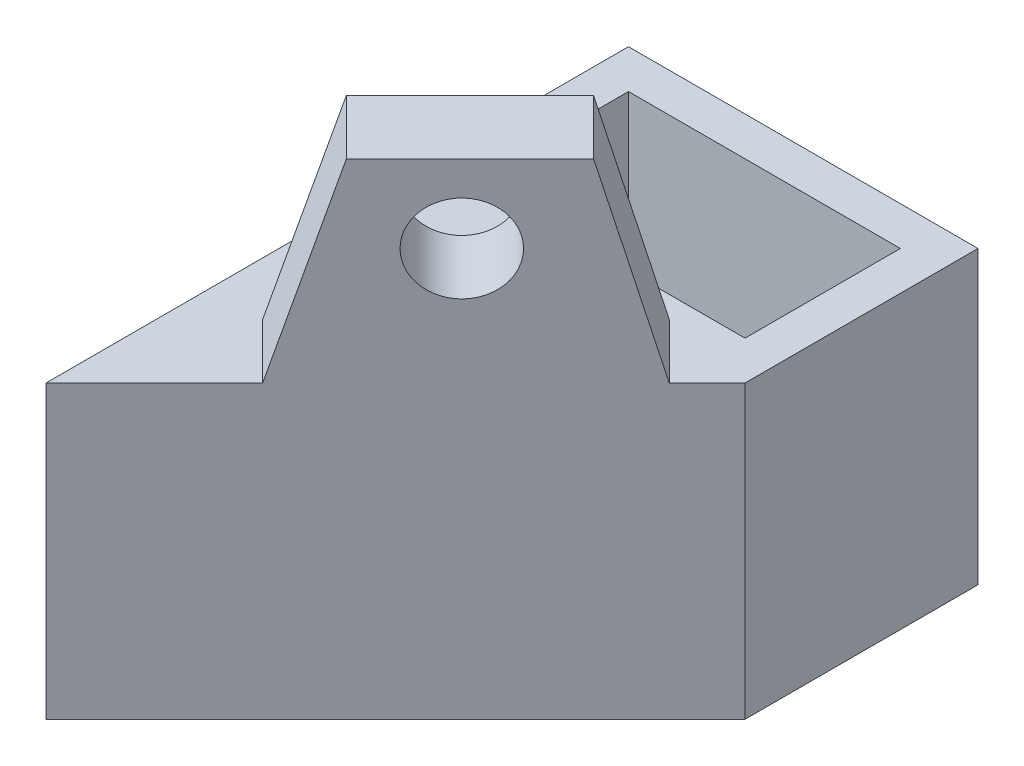
ISO-10303-21;
HEADER;
FILE_DESCRIPTION(('STEP AP214'),'2;1');
FILE_NAME('part.step','',(''),(''),'','','');
FILE_SCHEMA(('AUTOMOTIVE_DESIGN { 1 0 10303 214 1 1 1 1 }'));
ENDSEC;
DATA;
#1=APPLICATION_CONTEXT('core data for automotive mechanical design processes');
#2=APPLICATION_PROTOCOL_DEFINITION('international standard','automotive_design',2000,#1);
#3=PRODUCT_CONTEXT('',#1,'mechanical');
#4=PRODUCT('Part','Part','',(#3));
#5=PRODUCT_RELATED_PRODUCT_CATEGORY('part','',(#4));
#6=PRODUCT_DEFINITION_FORMATION('','',#4);
#7=PRODUCT_DEFINITION_CONTEXT('part definition',#1,'design');
#8=PRODUCT_DEFINITION('design','',#6,#7);
#9=PRODUCT_DEFINITION_SHAPE('','',#8);
#10=(LENGTH_UNIT() NAMED_UNIT(*) SI_UNIT(.MILLI.,.METRE.));
#11=(NAMED_UNIT(*) PLANE_ANGLE_UNIT() SI_UNIT($,.RADIAN.));
#12=(NAMED_UNIT(*) SI_UNIT($,.STERADIAN.) SOLID_ANGLE_UNIT());
#13=UNCERTAINTY_MEASURE_WITH_UNIT(LENGTH_MEASURE(1.E-05),#10,'distance_accuracy_value','');
#14=(GEOMETRIC_REPRESENTATION_CONTEXT(3) GLOBAL_UNCERTAINTY_ASSIGNED_CONTEXT((#13)) GLOBAL_UNIT_ASSIGNED_CONTEXT((#10,
#11,#12)) REPRESENTATION_CONTEXT('',''));
#15=CARTESIAN_POINT('',(0.,0.,0.));
#16=DIRECTION('',(0.,0.,1.));
#17=DIRECTION('',(1.,0.,0.));
#18=AXIS2_PLACEMENT_3D('',#15,#16,#17);
#19=CARTESIAN_POINT('',(0.,15.,0.));
#20=DIRECTION('',(0.,-1.,0.));
#21=DIRECTION('',(0.,0.,-1.));
#22=AXIS2_PLACEMENT_3D('',#19,#20,#21);
#23=PLANE('',#22);
#24=DIRECTION('',(0.,0.,1.));
#25=VECTOR('',#24,1.);
#26=CARTESIAN_POINT('',(2.,15.,-8.));
#27=LINE('',#26,#25);
#28=CARTESIAN_POINT('',(2.,15.,-8.));
#29=VERTEX_POINT('',#28);
#30=CARTESIAN_POINT('',(2.,15.,0.));
#31=VERTEX_POINT('',#30);
#32=EDGE_CURVE('E176',#29,#31,#27,.T.);
#33=ORIENTED_EDGE('',*,*,#32,.F.);
#34=DIRECTION('',(-1.,0.,0.));
#35=VECTOR('',#34,1.);
#36=CARTESIAN_POINT('',(2.,15.,-8.));
#37=LINE('',#36,#35);
#38=CARTESIAN_POINT('',(16.,15.,-8.));
#39=VERTEX_POINT('',#38);
#40=EDGE_CURVE('E183',#39,#29,#37,.T.);
#41=ORIENTED_EDGE('',*,*,#40,.F.);
#42=DIRECTION('',(0.,0.,-1.));
#43=VECTOR('',#42,1.);
#44=CARTESIAN_POINT('',(16.,15.,-8.));
#45=LINE('',#44,#43);
#46=CARTESIAN_POINT('',(16.,15.,0.));
#47=VERTEX_POINT('',#46);
#48=EDGE_CURVE('E181',#47,#39,#45,.T.);
#49=ORIENTED_EDGE('',*,*,#48,.F.);
#50=DIRECTION('',(1.,0.,0.));
#51=VECTOR('',#50,1.);
#52=CARTESIAN_POINT('',(2.,15.,0.));
#53=LINE('',#52,#51);
#54=EDGE_CURVE('E178',#31,#47,#53,.T.);
#55=ORIENTED_EDGE('',*,*,#54,.F.);
#56=EDGE_LOOP('',(#33,#41,#49,#55));
#57=FACE_BOUND('',#56,.T.);
#58=DIRECTION('',(0.707106781186548,0.,-0.707106781186547));
#59=VECTOR('',#58,1.);
#60=CARTESIAN_POINT('',(18.,15.,2.));
#61=LINE('',#60,#59);
#62=CARTESIAN_POINT('',(0.,15.,20.));
#63=VERTEX_POINT('',#62);
#64=CARTESIAN_POINT('',(5.57815467420012,15.,14.4218453257999));
#65=VERTEX_POINT('',#64);
#66=EDGE_CURVE('E153',#63,#65,#61,.T.);
#67=ORIENTED_EDGE('',*,*,#66,.T.);
#68=DIRECTION('',(0.707106781186547,0.,0.707106781186548));
#69=VECTOR('',#68,1.);
#70=CARTESIAN_POINT('',(2.74972754945393,15.,11.5934182010537));
#71=LINE('',#70,#69);
#72=CARTESIAN_POINT('',(2.74972754945393,15.,11.5934182010537));
#73=VERTEX_POINT('',#72);
#74=EDGE_CURVE('E145',#73,#65,#71,.T.);
#75=ORIENTED_EDGE('',*,*,#74,.F.);
#76=DIRECTION('',(-0.707106781186547,0.,0.707106781186548));
#77=VECTOR('',#76,1.);
#78=CARTESIAN_POINT('',(4.90630453423733,15.,9.43684121627029));
#79=LINE('',#78,#77);
#80=CARTESIAN_POINT('',(13.2218846115483,15.,1.12126113895937));
#81=VERTEX_POINT('',#80);
#82=EDGE_CURVE('E129',#81,#73,#79,.T.);
#83=ORIENTED_EDGE('',*,*,#82,.F.);
#84=DIRECTION('',(0.707106781186547,0.,0.707106781186548));
#85=VECTOR('',#84,1.);
#86=CARTESIAN_POINT('',(13.2218846115483,15.,1.12126113895937));
#87=LINE('',#86,#85);
#88=CARTESIAN_POINT('',(16.0503117362944,15.,3.94968826370556));
#89=VERTEX_POINT('',#88);
#90=EDGE_CURVE('E160',#81,#89,#87,.T.);
#91=ORIENTED_EDGE('',*,*,#90,.T.);
#92=CARTESIAN_POINT('',(18.,15.,2.));
#93=VERTEX_POINT('',#92);
#94=EDGE_CURVE('E39',#89,#93,#61,.T.);
#95=ORIENTED_EDGE('',*,*,#94,.T.);
#96=DIRECTION('',(0.,0.,-1.));
#97=VECTOR('',#96,1.);
#98=CARTESIAN_POINT('',(18.,15.,-10.));
#99=LINE('',#98,#97);
#100=CARTESIAN_POINT('',(18.,15.,-10.));
#101=VERTEX_POINT('',#100);
#102=EDGE_CURVE('E206',#93,#101,#99,.T.);
#103=ORIENTED_EDGE('',*,*,#102,.T.);
#104=DIRECTION('',(-1.,0.,0.));
#105=VECTOR('',#104,1.);
#106=CARTESIAN_POINT('',(0.,15.,-10.));
#107=LINE('',#106,#105);
#108=CARTESIAN_POINT('',(0.,15.,-10.));
#109=VERTEX_POINT('',#108);
#110=EDGE_CURVE('E218',#101,#109,#107,.T.);
#111=ORIENTED_EDGE('',*,*,#110,.T.);
#112=DIRECTION('',(0.,0.,1.));
#113=VECTOR('',#112,1.);
#114=CARTESIAN_POINT('',(0.,15.,20.));
#115=LINE('',#114,#113);
#116=EDGE_CURVE('E202',#109,#63,#115,.T.);
#117=ORIENTED_EDGE('',*,*,#116,.T.);
#118=EDGE_LOOP('',(#67,#75,#83,#91,#95,#103,#111,#117));
#119=FACE_BOUND('',#118,.T.);
#120=ADVANCED_FACE('F35',(#57,#119),#23,.F.);
#121=CARTESIAN_POINT('',(0.,0.,0.));
#122=DIRECTION('',(0.,-1.,0.));
#123=DIRECTION('',(0.,0.,-1.));
#124=AXIS2_PLACEMENT_3D('',#121,#122,#123);
#125=PLANE('',#124);
#126=DIRECTION('',(0.707106781186548,0.,-0.707106781186547));
#127=VECTOR('',#126,1.);
#128=CARTESIAN_POINT('',(18.,0.,2.));
#129=LINE('',#128,#127);
#130=CARTESIAN_POINT('',(0.,0.,20.));
#131=VERTEX_POINT('',#130);
#132=CARTESIAN_POINT('',(18.,0.,2.));
#133=VERTEX_POINT('',#132);
#134=EDGE_CURVE('E201',#131,#133,#129,.T.);
#135=ORIENTED_EDGE('',*,*,#134,.F.);
#136=DIRECTION('',(0.,0.,1.));
#137=VECTOR('',#136,1.);
#138=CARTESIAN_POINT('',(0.,0.,0.));
#139=LINE('',#138,#137);
#140=CARTESIAN_POINT('',(0.,0.,-10.));
#141=VERTEX_POINT('',#140);
#142=EDGE_CURVE('E203',#141,#131,#139,.T.);
#143=ORIENTED_EDGE('',*,*,#142,.F.);
#144=DIRECTION('',(-1.,0.,0.));
#145=VECTOR('',#144,1.);
#146=CARTESIAN_POINT('',(0.,0.,-10.));
#147=LINE('',#146,#145);
#148=CARTESIAN_POINT('',(18.,0.,-10.));
#149=VERTEX_POINT('',#148);
#150=EDGE_CURVE('E220',#149,#141,#147,.T.);
#151=ORIENTED_EDGE('',*,*,#150,.F.);
#152=DIRECTION('',(0.,0.,-1.));
#153=VECTOR('',#152,1.);
#154=CARTESIAN_POINT('',(18.,0.,-10.));
#155=LINE('',#154,#153);
#156=EDGE_CURVE('E222',#133,#149,#155,.T.);
#157=ORIENTED_EDGE('',*,*,#156,.F.);
#158=EDGE_LOOP('',(#135,#143,#151,#157));
#159=FACE_BOUND('',#158,.T.);
#160=DIRECTION('',(-1.,0.,0.));
#161=VECTOR('',#160,1.);
#162=CARTESIAN_POINT('',(2.,0.,-8.));
#163=LINE('',#162,#161);
#164=CARTESIAN_POINT('',(16.,0.,-8.));
#165=VERTEX_POINT('',#164);
#166=CARTESIAN_POINT('',(2.,0.,-8.));
#167=VERTEX_POINT('',#166);
#168=EDGE_CURVE('E179',#165,#167,#163,.T.);
#169=ORIENTED_EDGE('',*,*,#168,.T.);
#170=DIRECTION('',(0.,0.,1.));
#171=VECTOR('',#170,1.);
#172=CARTESIAN_POINT('',(2.,0.,-8.));
#173=LINE('',#172,#171);
#174=CARTESIAN_POINT('',(2.,0.,0.));
#175=VERTEX_POINT('',#174);
#176=EDGE_CURVE('E61',#167,#175,#173,.T.);
#177=ORIENTED_EDGE('',*,*,#176,.T.);
#178=DIRECTION('',(1.,0.,0.));
#179=VECTOR('',#178,1.);
#180=CARTESIAN_POINT('',(2.,0.,0.));
#181=LINE('',#180,#179);
#182=CARTESIAN_POINT('',(16.,0.,0.));
#183=VERTEX_POINT('',#182);
#184=EDGE_CURVE('E187',#175,#183,#181,.T.);
#185=ORIENTED_EDGE('',*,*,#184,.T.);
#186=DIRECTION('',(0.,0.,-1.));
#187=VECTOR('',#186,1.);
#188=CARTESIAN_POINT('',(16.,0.,-8.));
#189=LINE('',#188,#187);
#190=EDGE_CURVE('E190',#183,#165,#189,.T.);
#191=ORIENTED_EDGE('',*,*,#190,.T.);
#192=EDGE_LOOP('',(#169,#177,#185,#191));
#193=FACE_BOUND('',#192,.T.);
#194=ADVANCED_FACE('F243',(#159,#193),#125,.T.);
#195=CARTESIAN_POINT('',(18.,15.,2.));
#196=DIRECTION('',(-0.707106781186547,0.,-0.707106781186548));
#197=DIRECTION('',(-0.707106781186548,0.,0.707106781186547));
#198=AXIS2_PLACEMENT_3D('',#195,#196,#197);
#199=PLANE('',#198);
#200=ORIENTED_EDGE('',*,*,#94,.F.);
#201=DIRECTION('',(-0.187954989042648,0.964025852447929,0.187954989042647));
#202=VECTOR('',#201,1.);
#203=CARTESIAN_POINT('',(16.0503117362944,15.,3.94968826370556));
#204=LINE('',#203,#202);
#205=CARTESIAN_POINT('',(14.1006234725889,25.,5.89937652741112));
#206=VERTEX_POINT('',#205);
#207=EDGE_CURVE('E154',#89,#206,#204,.T.);
#208=ORIENTED_EDGE('',*,*,#207,.T.);
#209=DIRECTION('',(0.707106781186548,0.,-0.707106781186547));
#210=VECTOR('',#209,1.);
#211=CARTESIAN_POINT('',(7.73473165898352,25.,12.2652683410165));
#212=LINE('',#211,#210);
#213=CARTESIAN_POINT('',(7.73473165898352,25.,12.2652683410165));
#214=VERTEX_POINT('',#213);
#215=EDGE_CURVE('E140',#214,#206,#212,.T.);
#216=ORIENTED_EDGE('',*,*,#215,.F.);
#217=DIRECTION('',(-0.206277381525858,-0.956503676805098,0.206277381525858));
#218=VECTOR('',#217,1.);
#219=CARTESIAN_POINT('',(5.57815467420012,15.,14.4218453257999));
#220=LINE('',#219,#218);
#221=EDGE_CURVE('E149',#214,#65,#220,.T.);
#222=ORIENTED_EDGE('',*,*,#221,.T.);
#223=ORIENTED_EDGE('',*,*,#66,.F.);
#224=DIRECTION('',(0.,-1.,0.));
#225=VECTOR('',#224,1.);
#226=CARTESIAN_POINT('',(0.,15.,20.));
#227=LINE('',#226,#225);
#228=EDGE_CURVE('E11',#63,#131,#227,.T.);
#229=ORIENTED_EDGE('',*,*,#228,.T.);
#230=ORIENTED_EDGE('',*,*,#134,.T.);
#231=DIRECTION('',(0.,-1.,0.));
#232=VECTOR('',#231,1.);
#233=CARTESIAN_POINT('',(18.,15.,2.));
#234=LINE('',#233,#232);
#235=EDGE_CURVE('E45',#93,#133,#234,.T.);
#236=ORIENTED_EDGE('',*,*,#235,.F.);
#237=EDGE_LOOP('',(#200,#208,#216,#222,#223,#229,#230,#236));
#238=FACE_BOUND('',#237,.T.);
#239=CARTESIAN_POINT('',(10.7071067811866,21.,9.29289321881346));
#240=DIRECTION('',(-0.707106781186547,0.,-0.707106781186548));
#241=DIRECTION('',(-0.707106781186548,0.,0.707106781186547));
#242=AXIS2_PLACEMENT_3D('',#239,#240,#241);
#243=CIRCLE('',#242,2.25);
#244=CARTESIAN_POINT('',(9.11611652351682,21.,10.8838834764832));
#245=VERTEX_POINT('',#244);
#246=EDGE_CURVE('E141',#245,#245,#243,.T.);
#247=ORIENTED_EDGE('',*,*,#246,.T.);
#248=EDGE_LOOP('',(#247));
#249=FACE_BOUND('',#248,.T.);
#250=ADVANCED_FACE('F37',(#238,#249),#199,.F.);
#251=CARTESIAN_POINT('',(18.,15.,-10.));
#252=DIRECTION('',(-1.,0.,0.));
#253=DIRECTION('',(0.,0.,1.));
#254=AXIS2_PLACEMENT_3D('',#251,#252,#253);
#255=PLANE('',#254);
#256=ORIENTED_EDGE('',*,*,#156,.T.);
#257=DIRECTION('',(0.,-1.,0.));
#258=VECTOR('',#257,1.);
#259=CARTESIAN_POINT('',(18.,15.,-10.));
#260=LINE('',#259,#258);
#261=EDGE_CURVE('E212',#101,#149,#260,.T.);
#262=ORIENTED_EDGE('',*,*,#261,.F.);
#263=ORIENTED_EDGE('',*,*,#102,.F.);
#264=ORIENTED_EDGE('',*,*,#235,.T.);
#265=EDGE_LOOP('',(#256,#262,#263,#264));
#266=FACE_BOUND('',#265,.T.);
#267=ADVANCED_FACE('F232',(#266),#255,.F.);
#268=CARTESIAN_POINT('',(0.,15.,-10.));
#269=DIRECTION('',(0.,0.,1.));
#270=DIRECTION('',(1.,0.,0.));
#271=AXIS2_PLACEMENT_3D('',#268,#269,#270);
#272=PLANE('',#271);
#273=ORIENTED_EDGE('',*,*,#150,.T.);
#274=DIRECTION('',(0.,-1.,0.));
#275=VECTOR('',#274,1.);
#276=CARTESIAN_POINT('',(0.,15.,-10.));
#277=LINE('',#276,#275);
#278=EDGE_CURVE('E215',#109,#141,#277,.T.);
#279=ORIENTED_EDGE('',*,*,#278,.F.);
#280=ORIENTED_EDGE('',*,*,#110,.F.);
#281=ORIENTED_EDGE('',*,*,#261,.T.);
#282=EDGE_LOOP('',(#273,#279,#280,#281));
#283=FACE_BOUND('',#282,.T.);
#284=ADVANCED_FACE('F236',(#283),#272,.F.);
#285=CARTESIAN_POINT('',(0.,15.,0.));
#286=DIRECTION('',(1.,0.,0.));
#287=DIRECTION('',(0.,0.,-1.));
#288=AXIS2_PLACEMENT_3D('',#285,#286,#287);
#289=PLANE('',#288);
#290=ORIENTED_EDGE('',*,*,#142,.T.);
#291=ORIENTED_EDGE('',*,*,#228,.F.);
#292=ORIENTED_EDGE('',*,*,#116,.F.);
#293=ORIENTED_EDGE('',*,*,#278,.T.);
#294=EDGE_LOOP('',(#290,#291,#292,#293));
#295=FACE_BOUND('',#294,.T.);
#296=ADVANCED_FACE('F239',(#295),#289,.F.);
#297=CARTESIAN_POINT('',(2.,15.,-8.));
#298=DIRECTION('',(1.,0.,0.));
#299=DIRECTION('',(0.,0.,-1.));
#300=AXIS2_PLACEMENT_3D('',#297,#298,#299);
#301=PLANE('',#300);
#302=ORIENTED_EDGE('',*,*,#176,.F.);
#303=DIRECTION('',(0.,-1.,0.));
#304=VECTOR('',#303,1.);
#305=CARTESIAN_POINT('',(2.,15.,-8.));
#306=LINE('',#305,#304);
#307=EDGE_CURVE('E185',#29,#167,#306,.T.);
#308=ORIENTED_EDGE('',*,*,#307,.F.);
#309=ORIENTED_EDGE('',*,*,#32,.T.);
#310=DIRECTION('',(0.,-1.,0.));
#311=VECTOR('',#310,1.);
#312=CARTESIAN_POINT('',(2.,15.,0.));
#313=LINE('',#312,#311);
#314=EDGE_CURVE('E199',#31,#175,#313,.T.);
#315=ORIENTED_EDGE('',*,*,#314,.T.);
#316=EDGE_LOOP('',(#302,#308,#309,#315));
#317=FACE_BOUND('',#316,.T.);
#318=ADVANCED_FACE('F271',(#317),#301,.T.);
#319=CARTESIAN_POINT('',(2.,15.,0.));
#320=DIRECTION('',(0.,0.,-1.));
#321=DIRECTION('',(-1.,0.,0.));
#322=AXIS2_PLACEMENT_3D('',#319,#320,#321);
#323=PLANE('',#322);
#324=ORIENTED_EDGE('',*,*,#184,.F.);
#325=ORIENTED_EDGE('',*,*,#314,.F.);
#326=ORIENTED_EDGE('',*,*,#54,.T.);
#327=DIRECTION('',(0.,-1.,0.));
#328=VECTOR('',#327,1.);
#329=CARTESIAN_POINT('',(16.,15.,0.));
#330=LINE('',#329,#328);
#331=EDGE_CURVE('E197',#47,#183,#330,.T.);
#332=ORIENTED_EDGE('',*,*,#331,.T.);
#333=EDGE_LOOP('',(#324,#325,#326,#332));
#334=FACE_BOUND('',#333,.T.);
#335=ADVANCED_FACE('F315',(#334),#323,.T.);
#336=CARTESIAN_POINT('',(16.,15.,-8.));
#337=DIRECTION('',(-1.,0.,0.));
#338=DIRECTION('',(0.,0.,1.));
#339=AXIS2_PLACEMENT_3D('',#336,#337,#338);
#340=PLANE('',#339);
#341=ORIENTED_EDGE('',*,*,#190,.F.);
#342=ORIENTED_EDGE('',*,*,#331,.F.);
#343=ORIENTED_EDGE('',*,*,#48,.T.);
#344=DIRECTION('',(0.,-1.,0.));
#345=VECTOR('',#344,1.);
#346=CARTESIAN_POINT('',(16.,15.,-8.));
#347=LINE('',#346,#345);
#348=EDGE_CURVE('E53',#39,#165,#347,.T.);
#349=ORIENTED_EDGE('',*,*,#348,.T.);
#350=EDGE_LOOP('',(#341,#342,#343,#349));
#351=FACE_BOUND('',#350,.T.);
#352=ADVANCED_FACE('F323',(#351),#340,.T.);
#353=CARTESIAN_POINT('',(2.,15.,-8.));
#354=DIRECTION('',(0.,0.,1.));
#355=DIRECTION('',(1.,0.,0.));
#356=AXIS2_PLACEMENT_3D('',#353,#354,#355);
#357=PLANE('',#356);
#358=ORIENTED_EDGE('',*,*,#168,.F.);
#359=ORIENTED_EDGE('',*,*,#348,.F.);
#360=ORIENTED_EDGE('',*,*,#40,.T.);
#361=ORIENTED_EDGE('',*,*,#307,.T.);
#362=EDGE_LOOP('',(#358,#359,#360,#361));
#363=FACE_BOUND('',#362,.T.);
#364=ADVANCED_FACE('F332',(#363),#357,.T.);
#365=CARTESIAN_POINT('',(4.90630453423733,25.,9.43684121627029));
#366=DIRECTION('',(0.707106781186548,0.,0.707106781186547));
#367=DIRECTION('',(0.707106781186547,0.,-0.707106781186548));
#368=AXIS2_PLACEMENT_3D('',#365,#366,#367);
#369=PLANE('',#368);
#370=CARTESIAN_POINT('',(7.87867965644036,21.,6.46446609406726));
#371=DIRECTION('',(-0.707106781186548,0.,-0.707106781186548));
#372=DIRECTION('',(-0.707106781186548,0.,0.707106781186548));
#373=AXIS2_PLACEMENT_3D('',#370,#371,#372);
#374=CIRCLE('',#373,2.25);
#375=CARTESIAN_POINT('',(6.28768939877063,21.,8.05545635173699));
#376=VERTEX_POINT('',#375);
#377=EDGE_CURVE('E163',#376,#376,#374,.T.);
#378=ORIENTED_EDGE('',*,*,#377,.F.);
#379=EDGE_LOOP('',(#378));
#380=FACE_BOUND('',#379,.T.);
#381=ORIENTED_EDGE('',*,*,#82,.T.);
#382=DIRECTION('',(-0.206277381525858,-0.956503676805098,0.206277381525858));
#383=VECTOR('',#382,1.);
#384=CARTESIAN_POINT('',(2.74972754945393,15.,11.5934182010537));
#385=LINE('',#384,#383);
#386=CARTESIAN_POINT('',(4.90630453423733,25.,9.43684121627029));
#387=VERTEX_POINT('',#386);
#388=EDGE_CURVE('E133',#387,#73,#385,.T.);
#389=ORIENTED_EDGE('',*,*,#388,.F.);
#390=DIRECTION('',(-0.707106781186547,0.,0.707106781186548));
#391=VECTOR('',#390,1.);
#392=CARTESIAN_POINT('',(4.90630453423733,25.,9.43684121627029));
#393=LINE('',#392,#391);
#394=CARTESIAN_POINT('',(11.2721963478427,25.,3.07094940266493));
#395=VERTEX_POINT('',#394);
#396=EDGE_CURVE('E173',#395,#387,#393,.T.);
#397=ORIENTED_EDGE('',*,*,#396,.F.);
#398=DIRECTION('',(-0.187954989042648,0.964025852447929,0.187954989042647));
#399=VECTOR('',#398,1.);
#400=CARTESIAN_POINT('',(13.2218846115483,15.,1.12126113895937));
#401=LINE('',#400,#399);
#402=EDGE_CURVE('E135',#81,#395,#401,.T.);
#403=ORIENTED_EDGE('',*,*,#402,.F.);
#404=EDGE_LOOP('',(#381,#389,#397,#403));
#405=FACE_BOUND('',#404,.T.);
#406=ADVANCED_FACE('F131',(#380,#405),#369,.F.);
#407=CARTESIAN_POINT('',(0.,25.,0.));
#408=DIRECTION('',(0.,-1.,0.));
#409=DIRECTION('',(0.,0.,-1.));
#410=AXIS2_PLACEMENT_3D('',#407,#408,#409);
#411=PLANE('',#410);
#412=ORIENTED_EDGE('',*,*,#215,.T.);
#413=DIRECTION('',(-0.707106781186547,0.,-0.707106781186548));
#414=VECTOR('',#413,1.);
#415=CARTESIAN_POINT('',(11.2721963478427,25.,3.07094940266493));
#416=LINE('',#415,#414);
#417=EDGE_CURVE('E170',#206,#395,#416,.T.);
#418=ORIENTED_EDGE('',*,*,#417,.T.);
#419=ORIENTED_EDGE('',*,*,#396,.T.);
#420=DIRECTION('',(0.707106781186547,0.,0.707106781186547));
#421=VECTOR('',#420,1.);
#422=CARTESIAN_POINT('',(4.90630453423733,25.,9.43684121627029));
#423=LINE('',#422,#421);
#424=EDGE_CURVE('E148',#387,#214,#423,.T.);
#425=ORIENTED_EDGE('',*,*,#424,.T.);
#426=EDGE_LOOP('',(#412,#418,#419,#425));
#427=FACE_BOUND('',#426,.T.);
#428=ADVANCED_FACE('F249',(#427),#411,.F.);
#429=CARTESIAN_POINT('',(11.7677669529664,21.,10.3535533905933));
#430=DIRECTION('',(-0.707106781186548,0.,-0.707106781186548));
#431=DIRECTION('',(-0.707106781186548,0.,0.707106781186548));
#432=AXIS2_PLACEMENT_3D('',#429,#430,#431);
#433=CYLINDRICAL_SURFACE('',#432,2.25);
#434=ORIENTED_EDGE('',*,*,#377,.T.);
#435=EDGE_LOOP('',(#434));
#436=FACE_BOUND('',#435,.T.);
#437=ORIENTED_EDGE('',*,*,#246,.F.);
#438=EDGE_LOOP('',(#437));
#439=FACE_BOUND('',#438,.T.);
#440=ADVANCED_FACE('F253',(#436,#439),#433,.F.);
#441=CARTESIAN_POINT('',(13.2218846115483,15.,1.12126113895937));
#442=DIRECTION('',(0.681669217505073,0.265808494619799,-0.681669217505073));
#443=DIRECTION('',(-0.707106781186547,0.,-0.707106781186548));
#444=AXIS2_PLACEMENT_3D('',#441,#442,#443);
#445=PLANE('',#444);
#446=ORIENTED_EDGE('',*,*,#207,.F.);
#447=ORIENTED_EDGE('',*,*,#90,.F.);
#448=ORIENTED_EDGE('',*,*,#402,.T.);
#449=ORIENTED_EDGE('',*,*,#417,.F.);
#450=EDGE_LOOP('',(#446,#447,#448,#449));
#451=FACE_BOUND('',#450,.T.);
#452=ADVANCED_FACE('F251',(#451),#445,.T.);
#453=CARTESIAN_POINT('',(2.74972754945393,15.,11.5934182010537));
#454=DIRECTION('',(-0.676350236098751,0.291720270564677,0.676350236098751));
#455=DIRECTION('',(0.707106781186547,0.,0.707106781186548));
#456=AXIS2_PLACEMENT_3D('',#453,#454,#455);
#457=PLANE('',#456);
#458=ORIENTED_EDGE('',*,*,#221,.F.);
#459=ORIENTED_EDGE('',*,*,#424,.F.);
#460=ORIENTED_EDGE('',*,*,#388,.T.);
#461=ORIENTED_EDGE('',*,*,#74,.T.);
#462=EDGE_LOOP('',(#458,#459,#460,#461));
#463=FACE_BOUND('',#462,.T.);
#464=ADVANCED_FACE('F144',(#463),#457,.T.);
#465=CLOSED_SHELL('',(#120,#194,#250,#267,#284,#296,#318,#335,#352,#364,#406,#428,#440,#452,#464));
#466=MANIFOLD_SOLID_BREP('B2',#465);
#467=ADVANCED_BREP_SHAPE_REPRESENTATION('',(#18,#466),#14);
#468=SHAPE_DEFINITION_REPRESENTATION(#9,#467);
ENDSEC;
END-ISO-10303-21;
